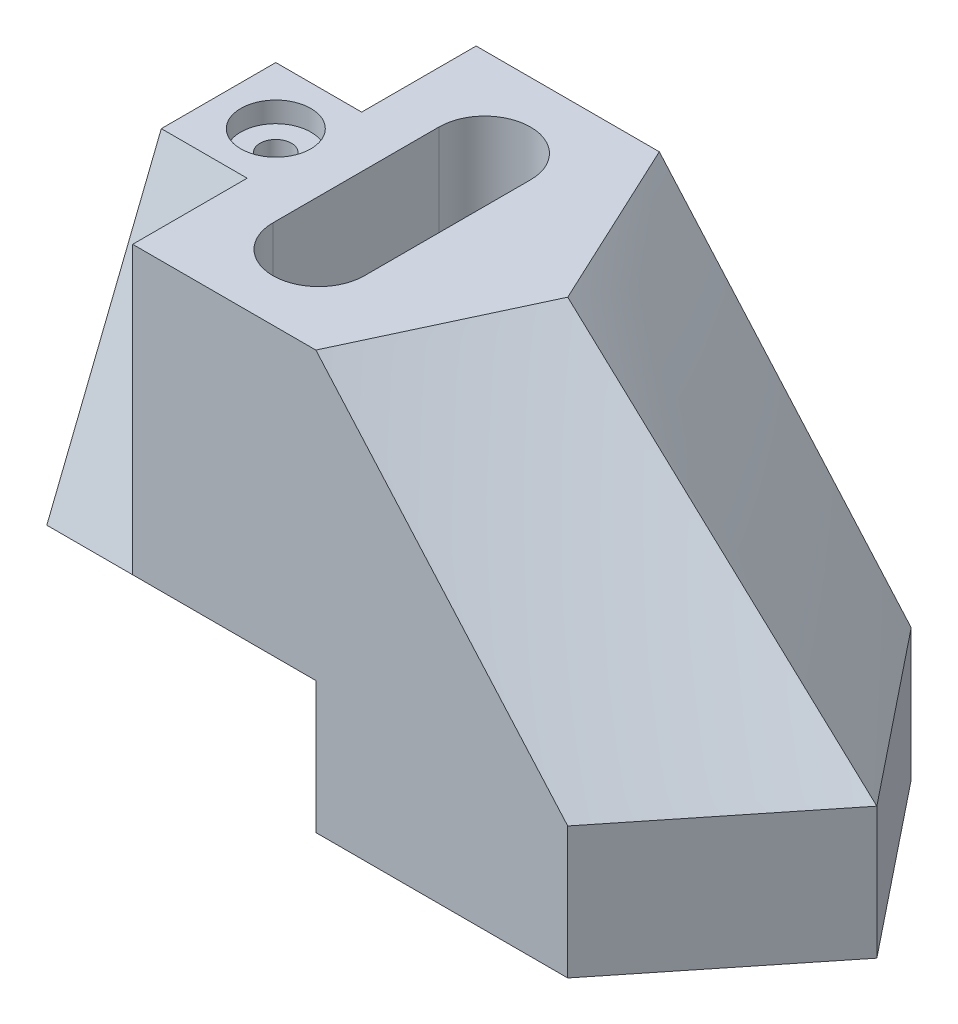
ISO-10303-21;
HEADER;
FILE_DESCRIPTION(('STEP AP214'),'2;1');
FILE_NAME('part.step','',(''),(''),'','','');
FILE_SCHEMA(('AUTOMOTIVE_DESIGN { 1 0 10303 214 1 1 1 1 }'));
ENDSEC;
DATA;
#1=APPLICATION_CONTEXT('core data for automotive mechanical design processes');
#2=APPLICATION_PROTOCOL_DEFINITION('international standard','automotive_design',2000,#1);
#3=PRODUCT_CONTEXT('',#1,'mechanical');
#4=PRODUCT('Part','Part','',(#3));
#5=PRODUCT_RELATED_PRODUCT_CATEGORY('part','',(#4));
#6=PRODUCT_DEFINITION_FORMATION('','',#4);
#7=PRODUCT_DEFINITION_CONTEXT('part definition',#1,'design');
#8=PRODUCT_DEFINITION('design','',#6,#7);
#9=PRODUCT_DEFINITION_SHAPE('','',#8);
#10=(LENGTH_UNIT() NAMED_UNIT(*) SI_UNIT(.MILLI.,.METRE.));
#11=(NAMED_UNIT(*) PLANE_ANGLE_UNIT() SI_UNIT($,.RADIAN.));
#12=(NAMED_UNIT(*) SI_UNIT($,.STERADIAN.) SOLID_ANGLE_UNIT());
#13=UNCERTAINTY_MEASURE_WITH_UNIT(LENGTH_MEASURE(1.E-05),#10,'distance_accuracy_value','');
#14=(GEOMETRIC_REPRESENTATION_CONTEXT(3) GLOBAL_UNCERTAINTY_ASSIGNED_CONTEXT((#13)) GLOBAL_UNIT_ASSIGNED_CONTEXT((#10,
#11,#12)) REPRESENTATION_CONTEXT('',''));
#15=CARTESIAN_POINT('',(0.,0.,0.));
#16=DIRECTION('',(0.,0.,1.));
#17=DIRECTION('',(1.,0.,0.));
#18=AXIS2_PLACEMENT_3D('',#15,#16,#17);
#19=CARTESIAN_POINT('',(0.,0.,-30.));
#20=DIRECTION('',(0.,0.,-1.));
#21=DIRECTION('',(-1.,0.,0.));
#22=AXIS2_PLACEMENT_3D('',#19,#20,#21);
#23=PLANE('',#22);
#24=DIRECTION('',(1.,0.,0.));
#25=VECTOR('',#24,1.);
#26=CARTESIAN_POINT('',(0.,0.,-30.));
#27=LINE('',#26,#25);
#28=CARTESIAN_POINT('',(15.,0.,-30.));
#29=VERTEX_POINT('',#28);
#30=CARTESIAN_POINT('',(47.,0.,-30.));
#31=VERTEX_POINT('',#30);
#32=EDGE_CURVE('E277',#29,#31,#27,.T.);
#33=ORIENTED_EDGE('',*,*,#32,.F.);
#34=DIRECTION('',(0.,-1.,0.));
#35=VECTOR('',#34,1.);
#36=CARTESIAN_POINT('',(15.,50.,-30.));
#37=LINE('',#36,#35);
#38=CARTESIAN_POINT('',(15.,50.,-30.));
#39=VERTEX_POINT('',#38);
#40=EDGE_CURVE('E452',#39,#29,#37,.T.);
#41=ORIENTED_EDGE('',*,*,#40,.F.);
#42=DIRECTION('',(-1.,0.,0.));
#43=VECTOR('',#42,1.);
#44=CARTESIAN_POINT('',(47.,50.,-30.));
#45=LINE('',#44,#43);
#46=CARTESIAN_POINT('',(47.,50.,-30.));
#47=VERTEX_POINT('',#46);
#48=EDGE_CURVE('E442',#47,#39,#45,.T.);
#49=ORIENTED_EDGE('',*,*,#48,.F.);
#50=DIRECTION('',(0.660627894892025,-0.750713516922755,0.));
#51=VECTOR('',#50,1.);
#52=CARTESIAN_POINT('',(47.,50.,-30.));
#53=LINE('',#52,#51);
#54=CARTESIAN_POINT('',(91.,0.,-30.));
#55=VERTEX_POINT('',#54);
#56=EDGE_CURVE('E303',#47,#55,#53,.T.);
#57=ORIENTED_EDGE('',*,*,#56,.T.);
#58=DIRECTION('',(0.,1.,0.));
#59=VECTOR('',#58,1.);
#60=CARTESIAN_POINT('',(91.,-23.,-30.));
#61=LINE('',#60,#59);
#62=CARTESIAN_POINT('',(91.,-23.,-30.));
#63=VERTEX_POINT('',#62);
#64=EDGE_CURVE('E483',#63,#55,#61,.T.);
#65=ORIENTED_EDGE('',*,*,#64,.F.);
#66=DIRECTION('',(1.,0.,0.));
#67=VECTOR('',#66,1.);
#68=CARTESIAN_POINT('',(0.,-23.,-30.));
#69=LINE('',#68,#67);
#70=CARTESIAN_POINT('',(47.,-23.,-30.));
#71=VERTEX_POINT('',#70);
#72=EDGE_CURVE('E287',#71,#63,#69,.T.);
#73=ORIENTED_EDGE('',*,*,#72,.F.);
#74=DIRECTION('',(0.,-1.,0.));
#75=VECTOR('',#74,1.);
#76=CARTESIAN_POINT('',(47.,0.,-30.));
#77=LINE('',#76,#75);
#78=EDGE_CURVE('E274',#31,#71,#77,.T.);
#79=ORIENTED_EDGE('',*,*,#78,.F.);
#80=EDGE_LOOP('',(#33,#41,#49,#57,#65,#73,#79));
#81=FACE_BOUND('',#80,.T.);
#82=ADVANCED_FACE('F49',(#81),#23,.T.);
#83=CARTESIAN_POINT('',(0.,50.,0.));
#84=DIRECTION('',(0.,1.,0.));
#85=DIRECTION('',(0.,0.,1.));
#86=AXIS2_PLACEMENT_3D('',#83,#84,#85);
#87=PLANE('',#86);
#88=CARTESIAN_POINT('',(10.,50.,0.));
#89=DIRECTION('',(0.,1.,0.));
#90=DIRECTION('',(0.,0.,1.));
#91=AXIS2_PLACEMENT_3D('',#88,#89,#90);
#92=CIRCLE('',#91,6.12);
#93=CARTESIAN_POINT('',(10.,50.,6.12));
#94=VERTEX_POINT('',#93);
#95=EDGE_CURVE('E805',#94,#94,#92,.T.);
#96=ORIENTED_EDGE('',*,*,#95,.F.);
#97=EDGE_LOOP('',(#96));
#98=FACE_BOUND('',#97,.T.);
#99=CARTESIAN_POINT('',(32.,50.,-14.5));
#100=DIRECTION('',(0.,1.,0.));
#101=DIRECTION('',(0.,0.,1.));
#102=AXIS2_PLACEMENT_3D('',#99,#100,#101);
#103=CIRCLE('',#102,8.00000000000002);
#104=CARTESIAN_POINT('',(40.,50.,-14.5));
#105=VERTEX_POINT('',#104);
#106=CARTESIAN_POINT('',(24.,50.,-14.5));
#107=VERTEX_POINT('',#106);
#108=EDGE_CURVE('E75',#105,#107,#103,.T.);
#109=ORIENTED_EDGE('',*,*,#108,.F.);
#110=DIRECTION('',(0.,0.,-1.));
#111=VECTOR('',#110,1.);
#112=CARTESIAN_POINT('',(40.,50.,-14.5));
#113=LINE('',#112,#111);
#114=CARTESIAN_POINT('',(40.,50.,14.5));
#115=VERTEX_POINT('',#114);
#116=EDGE_CURVE('E223',#115,#105,#113,.T.);
#117=ORIENTED_EDGE('',*,*,#116,.F.);
#118=CARTESIAN_POINT('',(32.,50.,14.5));
#119=DIRECTION('',(0.,1.,0.));
#120=DIRECTION('',(0.,0.,1.));
#121=AXIS2_PLACEMENT_3D('',#118,#119,#120);
#122=CIRCLE('',#121,8.00000000000001);
#123=CARTESIAN_POINT('',(24.,50.,14.5));
#124=VERTEX_POINT('',#123);
#125=EDGE_CURVE('E237',#124,#115,#122,.T.);
#126=ORIENTED_EDGE('',*,*,#125,.F.);
#127=DIRECTION('',(0.,0.,1.));
#128=VECTOR('',#127,1.);
#129=CARTESIAN_POINT('',(24.,50.,-14.5));
#130=LINE('',#129,#128);
#131=EDGE_CURVE('E234',#107,#124,#130,.T.);
#132=ORIENTED_EDGE('',*,*,#131,.F.);
#133=EDGE_LOOP('',(#109,#117,#126,#132));
#134=FACE_BOUND('',#133,.T.);
#135=DIRECTION('',(-1.,0.,0.));
#136=VECTOR('',#135,1.);
#137=CARTESIAN_POINT('',(15.,50.,-10.));
#138=LINE('',#137,#136);
#139=CARTESIAN_POINT('',(15.,50.,-10.));
#140=VERTEX_POINT('',#139);
#141=CARTESIAN_POINT('',(0.,50.,-10.));
#142=VERTEX_POINT('',#141);
#143=EDGE_CURVE('E424',#140,#142,#138,.T.);
#144=ORIENTED_EDGE('',*,*,#143,.T.);
#145=DIRECTION('',(0.,0.,1.));
#146=VECTOR('',#145,1.);
#147=CARTESIAN_POINT('',(0.,50.,-30.));
#148=LINE('',#147,#146);
#149=CARTESIAN_POINT('',(0.,50.,10.));
#150=VERTEX_POINT('',#149);
#151=EDGE_CURVE('E415',#142,#150,#148,.T.);
#152=ORIENTED_EDGE('',*,*,#151,.T.);
#153=DIRECTION('',(-1.,0.,0.));
#154=VECTOR('',#153,1.);
#155=CARTESIAN_POINT('',(15.,50.,10.));
#156=LINE('',#155,#154);
#157=CARTESIAN_POINT('',(15.,50.,10.));
#158=VERTEX_POINT('',#157);
#159=EDGE_CURVE('E262',#158,#150,#156,.T.);
#160=ORIENTED_EDGE('',*,*,#159,.F.);
#161=DIRECTION('',(0.,0.,-1.));
#162=VECTOR('',#161,1.);
#163=CARTESIAN_POINT('',(15.,50.,10.));
#164=LINE('',#163,#162);
#165=CARTESIAN_POINT('',(15.,50.,30.));
#166=VERTEX_POINT('',#165);
#167=EDGE_CURVE('E263',#166,#158,#164,.T.);
#168=ORIENTED_EDGE('',*,*,#167,.F.);
#169=DIRECTION('',(1.,0.,0.));
#170=VECTOR('',#169,1.);
#171=CARTESIAN_POINT('',(0.,50.,30.));
#172=LINE('',#171,#170);
#173=CARTESIAN_POINT('',(47.,50.,30.));
#174=VERTEX_POINT('',#173);
#175=EDGE_CURVE('E474',#166,#174,#172,.T.);
#176=ORIENTED_EDGE('',*,*,#175,.T.);
#177=DIRECTION('',(0.422885465331124,0.,-0.906183139995265));
#178=VECTOR('',#177,1.);
#179=CARTESIAN_POINT('',(47.,50.,30.));
#180=LINE('',#179,#178);
#181=CARTESIAN_POINT('',(61.,50.,0.));
#182=VERTEX_POINT('',#181);
#183=EDGE_CURVE('E362',#174,#182,#180,.T.);
#184=ORIENTED_EDGE('',*,*,#183,.T.);
#185=DIRECTION('',(-0.422885465331124,0.,-0.906183139995265));
#186=VECTOR('',#185,1.);
#187=CARTESIAN_POINT('',(61.,50.,0.));
#188=LINE('',#187,#186);
#189=EDGE_CURVE('E297',#182,#47,#188,.T.);
#190=ORIENTED_EDGE('',*,*,#189,.T.);
#191=ORIENTED_EDGE('',*,*,#48,.T.);
#192=DIRECTION('',(0.,0.,-1.));
#193=VECTOR('',#192,1.);
#194=CARTESIAN_POINT('',(15.,50.,-10.));
#195=LINE('',#194,#193);
#196=EDGE_CURVE('E253',#140,#39,#195,.T.);
#197=ORIENTED_EDGE('',*,*,#196,.F.);
#198=EDGE_LOOP('',(#144,#152,#160,#168,#176,#184,#190,#191,#197));
#199=FACE_BOUND('',#198,.T.);
#200=ADVANCED_FACE('F373',(#98,#134,#199),#87,.T.);
#201=CARTESIAN_POINT('',(0.,0.,0.));
#202=DIRECTION('',(-1.,0.,0.));
#203=DIRECTION('',(0.,0.,1.));
#204=AXIS2_PLACEMENT_3D('',#201,#202,#203);
#205=PLANE('',#204);
#206=DIRECTION('',(0.,0.928476690885259,0.371390676354104));
#207=VECTOR('',#206,1.);
#208=CARTESIAN_POINT('',(0.,0.,-30.));
#209=LINE('',#208,#207);
#210=CARTESIAN_POINT('',(0.,0.,-30.));
#211=VERTEX_POINT('',#210);
#212=EDGE_CURVE('E244',#211,#142,#209,.T.);
#213=ORIENTED_EDGE('',*,*,#212,.F.);
#214=DIRECTION('',(0.,0.,1.));
#215=VECTOR('',#214,1.);
#216=CARTESIAN_POINT('',(0.,0.,-30.0001));
#217=LINE('',#216,#215);
#218=CARTESIAN_POINT('',(0.,0.,30.));
#219=VERTEX_POINT('',#218);
#220=EDGE_CURVE('E271',#211,#219,#217,.T.);
#221=ORIENTED_EDGE('',*,*,#220,.T.);
#222=DIRECTION('',(0.,-0.928476690885259,0.371390676354104));
#223=VECTOR('',#222,1.);
#224=CARTESIAN_POINT('',(0.,0.,30.));
#225=LINE('',#224,#223);
#226=EDGE_CURVE('E258',#150,#219,#225,.T.);
#227=ORIENTED_EDGE('',*,*,#226,.F.);
#228=ORIENTED_EDGE('',*,*,#151,.F.);
#229=EDGE_LOOP('',(#213,#221,#227,#228));
#230=FACE_BOUND('',#229,.T.);
#231=ADVANCED_FACE('F317',(#230),#205,.T.);
#232=CARTESIAN_POINT('',(47.,50.,-30.));
#233=CARTESIAN_POINT('',(91.,0.,-30.));
#234=CARTESIAN_POINT('',(49.3333333333333,50.,-25.));
#235=CARTESIAN_POINT('',(95.,0.,-25.));
#236=CARTESIAN_POINT('',(51.6666666666667,50.,-20.));
#237=CARTESIAN_POINT('',(99.,0.,-20.));
#238=CARTESIAN_POINT('',(56.3333333333333,50.,-10.));
#239=CARTESIAN_POINT('',(107.,0.,-10.));
#240=CARTESIAN_POINT('',(58.6666666666667,50.,-5.));
#241=CARTESIAN_POINT('',(111.,0.,-5.00000000000001));
#242=CARTESIAN_POINT('',(61.,50.,0.));
#243=CARTESIAN_POINT('',(115.,0.,0.));
#244=B_SPLINE_SURFACE_WITH_KNOTS('',3,1,((#232,#233),(#234,#235),(#236,#237),(#238,#239),(#240,
#241),(#242,#243)),.UNSPECIFIED.,.F.,.F.,.F.,(4,2,4),(2,2),(0.,0.5,1.),(0.,1.),.UNSPECIFIED.);
#245=DIRECTION('',(0.733760674018169,-0.679408031498305,0.));
#246=VECTOR('',#245,1.);
#247=CARTESIAN_POINT('',(88.,25.,0.));
#248=LINE('',#247,#246);
#249=CARTESIAN_POINT('',(115.,0.,0.));
#250=VERTEX_POINT('',#249);
#251=EDGE_CURVE('E456',#182,#250,#248,.T.);
#252=DIRECTION('',(-0.624695047554424,0.,-0.78086880944303));
#253=VECTOR('',#252,1.);
#254=CARTESIAN_POINT('',(91.,0.,-30.));
#255=LINE('',#254,#253);
#256=EDGE_CURVE('E59',#250,#55,#255,.T.);
#257=ORIENTED_EDGE('',*,*,#189,.F.);
#258=ORIENTED_EDGE('',*,*,#251,.T.);
#259=ORIENTED_EDGE('',*,*,#256,.T.);
#260=ORIENTED_EDGE('',*,*,#56,.F.);
#261=EDGE_LOOP('',(#257,#258,#259,#260));
#262=FACE_BOUND('',#261,.T.);
#263=ADVANCED_FACE('F305',(#262),#244,.T.);
#264=CARTESIAN_POINT('',(61.,50.,0.));
#265=CARTESIAN_POINT('',(115.,0.,0.));
#266=CARTESIAN_POINT('',(58.6666666666667,50.,5.));
#267=CARTESIAN_POINT('',(111.,0.,4.99999999999993));
#268=CARTESIAN_POINT('',(56.3333333333333,50.,9.99999999999999));
#269=CARTESIAN_POINT('',(107.,0.,9.9999999999999));
#270=CARTESIAN_POINT('',(51.6666666666667,50.,20.));
#271=CARTESIAN_POINT('',(99.0000000000001,0.,19.9999999999999));
#272=CARTESIAN_POINT('',(49.3333333333333,50.,25.));
#273=CARTESIAN_POINT('',(95.,0.,24.9999999999999));
#274=CARTESIAN_POINT('',(47.,50.,30.));
#275=CARTESIAN_POINT('',(91.,0.,30.));
#276=B_SPLINE_SURFACE_WITH_KNOTS('',3,1,((#264,#265),(#266,#267),(#268,#269),(#270,#271),(#272,
#273),(#274,#275)),.UNSPECIFIED.,.F.,.F.,.F.,(4,2,4),(2,2),(0.,0.5,1.),(0.,1.),.UNSPECIFIED.);
#277=DIRECTION('',(0.660627894892025,-0.750713516922755,0.));
#278=VECTOR('',#277,1.);
#279=CARTESIAN_POINT('',(69.,25.,30.));
#280=LINE('',#279,#278);
#281=CARTESIAN_POINT('',(91.,0.,30.));
#282=VERTEX_POINT('',#281);
#283=EDGE_CURVE('E457',#174,#282,#280,.T.);
#284=DIRECTION('',(0.624695047554424,0.,-0.78086880944303));
#285=VECTOR('',#284,1.);
#286=CARTESIAN_POINT('',(91.,0.,30.));
#287=LINE('',#286,#285);
#288=EDGE_CURVE('E346',#282,#250,#287,.T.);
#289=ORIENTED_EDGE('',*,*,#183,.F.);
#290=ORIENTED_EDGE('',*,*,#283,.T.);
#291=ORIENTED_EDGE('',*,*,#288,.T.);
#292=ORIENTED_EDGE('',*,*,#251,.F.);
#293=EDGE_LOOP('',(#289,#290,#291,#292));
#294=FACE_BOUND('',#293,.T.);
#295=ADVANCED_FACE('F316',(#294),#276,.T.);
#296=CARTESIAN_POINT('',(0.,0.,30.));
#297=DIRECTION('',(0.,0.,1.));
#298=DIRECTION('',(1.,0.,0.));
#299=AXIS2_PLACEMENT_3D('',#296,#297,#298);
#300=PLANE('',#299);
#301=DIRECTION('',(0.,1.,0.));
#302=VECTOR('',#301,1.);
#303=CARTESIAN_POINT('',(15.,50.,30.));
#304=LINE('',#303,#302);
#305=CARTESIAN_POINT('',(15.,0.,30.));
#306=VERTEX_POINT('',#305);
#307=EDGE_CURVE('E257',#306,#166,#304,.T.);
#308=ORIENTED_EDGE('',*,*,#307,.F.);
#309=DIRECTION('',(-1.,0.,0.));
#310=VECTOR('',#309,1.);
#311=CARTESIAN_POINT('',(0.,0.,30.));
#312=LINE('',#311,#310);
#313=CARTESIAN_POINT('',(47.,0.,30.));
#314=VERTEX_POINT('',#313);
#315=EDGE_CURVE('E267',#314,#306,#312,.T.);
#316=ORIENTED_EDGE('',*,*,#315,.F.);
#317=DIRECTION('',(0.,1.,0.));
#318=VECTOR('',#317,1.);
#319=CARTESIAN_POINT('',(47.,0.,30.));
#320=LINE('',#319,#318);
#321=CARTESIAN_POINT('',(47.,-23.,30.));
#322=VERTEX_POINT('',#321);
#323=EDGE_CURVE('E264',#322,#314,#320,.T.);
#324=ORIENTED_EDGE('',*,*,#323,.F.);
#325=DIRECTION('',(-1.,0.,0.));
#326=VECTOR('',#325,1.);
#327=CARTESIAN_POINT('',(91.,-23.,30.));
#328=LINE('',#327,#326);
#329=CARTESIAN_POINT('',(91.,-23.,30.));
#330=VERTEX_POINT('',#329);
#331=EDGE_CURVE('E284',#330,#322,#328,.T.);
#332=ORIENTED_EDGE('',*,*,#331,.F.);
#333=DIRECTION('',(0.,1.,0.));
#334=VECTOR('',#333,1.);
#335=CARTESIAN_POINT('',(91.,-23.,30.));
#336=LINE('',#335,#334);
#337=EDGE_CURVE('E454',#330,#282,#336,.T.);
#338=ORIENTED_EDGE('',*,*,#337,.T.);
#339=ORIENTED_EDGE('',*,*,#283,.F.);
#340=ORIENTED_EDGE('',*,*,#175,.F.);
#341=EDGE_LOOP('',(#308,#316,#324,#332,#338,#339,#340));
#342=FACE_BOUND('',#341,.T.);
#343=ADVANCED_FACE('F51',(#342),#300,.T.);
#344=CARTESIAN_POINT('',(115.,-23.,0.));
#345=DIRECTION('',(-0.78086880944303,0.,-0.624695047554424));
#346=DIRECTION('',(-0.624695047554424,0.,0.78086880944303));
#347=AXIS2_PLACEMENT_3D('',#344,#345,#346);
#348=PLANE('',#347);
#349=ORIENTED_EDGE('',*,*,#288,.F.);
#350=ORIENTED_EDGE('',*,*,#337,.F.);
#351=DIRECTION('',(-0.624695047554424,0.,0.78086880944303));
#352=VECTOR('',#351,1.);
#353=CARTESIAN_POINT('',(115.,-23.,0.));
#354=LINE('',#353,#352);
#355=CARTESIAN_POINT('',(115.,-23.,0.));
#356=VERTEX_POINT('',#355);
#357=EDGE_CURVE('E281',#356,#330,#354,.T.);
#358=ORIENTED_EDGE('',*,*,#357,.F.);
#359=DIRECTION('',(0.,1.,0.));
#360=VECTOR('',#359,1.);
#361=CARTESIAN_POINT('',(115.,-23.,0.));
#362=LINE('',#361,#360);
#363=EDGE_CURVE('E291',#356,#250,#362,.T.);
#364=ORIENTED_EDGE('',*,*,#363,.T.);
#365=EDGE_LOOP('',(#349,#350,#358,#364));
#366=FACE_BOUND('',#365,.T.);
#367=ADVANCED_FACE('F383',(#366),#348,.F.);
#368=CARTESIAN_POINT('',(91.,-23.,-30.));
#369=DIRECTION('',(-0.78086880944303,0.,0.624695047554424));
#370=DIRECTION('',(0.624695047554424,0.,0.78086880944303));
#371=AXIS2_PLACEMENT_3D('',#368,#369,#370);
#372=PLANE('',#371);
#373=ORIENTED_EDGE('',*,*,#256,.F.);
#374=ORIENTED_EDGE('',*,*,#363,.F.);
#375=DIRECTION('',(0.624695047554424,0.,0.78086880944303));
#376=VECTOR('',#375,1.);
#377=CARTESIAN_POINT('',(91.,-23.,-30.));
#378=LINE('',#377,#376);
#379=EDGE_CURVE('E289',#63,#356,#378,.T.);
#380=ORIENTED_EDGE('',*,*,#379,.F.);
#381=ORIENTED_EDGE('',*,*,#64,.T.);
#382=EDGE_LOOP('',(#373,#374,#380,#381));
#383=FACE_BOUND('',#382,.T.);
#384=ADVANCED_FACE('F509',(#383),#372,.F.);
#385=CARTESIAN_POINT('',(0.,-23.,0.));
#386=DIRECTION('',(0.,1.,0.));
#387=DIRECTION('',(0.,0.,1.));
#388=AXIS2_PLACEMENT_3D('',#385,#386,#387);
#389=PLANE('',#388);
#390=ORIENTED_EDGE('',*,*,#331,.T.);
#391=DIRECTION('',(0.,0.,-1.));
#392=VECTOR('',#391,1.);
#393=CARTESIAN_POINT('',(47.,-23.,0.));
#394=LINE('',#393,#392);
#395=EDGE_CURVE('E12',#322,#71,#394,.T.);
#396=ORIENTED_EDGE('',*,*,#395,.T.);
#397=ORIENTED_EDGE('',*,*,#72,.T.);
#398=ORIENTED_EDGE('',*,*,#379,.T.);
#399=ORIENTED_EDGE('',*,*,#357,.T.);
#400=EDGE_LOOP('',(#390,#396,#397,#398,#399));
#401=FACE_BOUND('',#400,.T.);
#402=ADVANCED_FACE('F514',(#401),#389,.F.);
#403=CARTESIAN_POINT('',(0.,0.,-30.0001));
#404=DIRECTION('',(0.,1.,0.));
#405=DIRECTION('',(0.,0.,1.));
#406=AXIS2_PLACEMENT_3D('',#403,#404,#405);
#407=PLANE('',#406);
#408=CARTESIAN_POINT('',(10.,0.,0.));
#409=DIRECTION('',(0.,1.,0.));
#410=DIRECTION('',(0.,0.,1.));
#411=AXIS2_PLACEMENT_3D('',#408,#409,#410);
#412=CIRCLE('',#411,2.75);
#413=CARTESIAN_POINT('',(10.,0.,2.75));
#414=VERTEX_POINT('',#413);
#415=EDGE_CURVE('E54',#414,#414,#412,.T.);
#416=ORIENTED_EDGE('',*,*,#415,.T.);
#417=EDGE_LOOP('',(#416));
#418=FACE_BOUND('',#417,.T.);
#419=CARTESIAN_POINT('',(32.,0.,-14.5));
#420=DIRECTION('',(0.,1.,0.));
#421=DIRECTION('',(0.,0.,1.));
#422=AXIS2_PLACEMENT_3D('',#419,#420,#421);
#423=CIRCLE('',#422,3.00000000000001);
#424=CARTESIAN_POINT('',(35.,0.,-14.5));
#425=VERTEX_POINT('',#424);
#426=CARTESIAN_POINT('',(29.,0.,-14.5));
#427=VERTEX_POINT('',#426);
#428=EDGE_CURVE('E207',#425,#427,#423,.T.);
#429=ORIENTED_EDGE('',*,*,#428,.T.);
#430=DIRECTION('',(0.,0.,1.));
#431=VECTOR('',#430,1.);
#432=CARTESIAN_POINT('',(29.,0.,-30.0001));
#433=LINE('',#432,#431);
#434=CARTESIAN_POINT('',(29.,0.,14.5));
#435=VERTEX_POINT('',#434);
#436=EDGE_CURVE('E198',#427,#435,#433,.T.);
#437=ORIENTED_EDGE('',*,*,#436,.T.);
#438=CARTESIAN_POINT('',(32.,0.,14.5));
#439=DIRECTION('',(0.,1.,0.));
#440=DIRECTION('',(0.,0.,1.));
#441=AXIS2_PLACEMENT_3D('',#438,#439,#440);
#442=CIRCLE('',#441,3.00000000000001);
#443=CARTESIAN_POINT('',(35.,0.,14.5));
#444=VERTEX_POINT('',#443);
#445=EDGE_CURVE('E184',#435,#444,#442,.T.);
#446=ORIENTED_EDGE('',*,*,#445,.T.);
#447=DIRECTION('',(0.,0.,1.));
#448=VECTOR('',#447,1.);
#449=CARTESIAN_POINT('',(35.,0.,-30.0001));
#450=LINE('',#449,#448);
#451=EDGE_CURVE('E192',#425,#444,#450,.T.);
#452=ORIENTED_EDGE('',*,*,#451,.F.);
#453=EDGE_LOOP('',(#429,#437,#446,#452));
#454=FACE_BOUND('',#453,.T.);
#455=EDGE_CURVE('E278',#211,#29,#27,.T.);
#456=ORIENTED_EDGE('',*,*,#455,.T.);
#457=ORIENTED_EDGE('',*,*,#32,.T.);
#458=DIRECTION('',(0.,0.,1.));
#459=VECTOR('',#458,1.);
#460=CARTESIAN_POINT('',(47.,0.,-30.0001));
#461=LINE('',#460,#459);
#462=EDGE_CURVE('E270',#31,#314,#461,.T.);
#463=ORIENTED_EDGE('',*,*,#462,.T.);
#464=ORIENTED_EDGE('',*,*,#315,.T.);
#465=DIRECTION('',(-1.,0.,0.));
#466=VECTOR('',#465,1.);
#467=CARTESIAN_POINT('',(15.,0.,30.));
#468=LINE('',#467,#466);
#469=EDGE_CURVE('E259',#306,#219,#468,.T.);
#470=ORIENTED_EDGE('',*,*,#469,.T.);
#471=ORIENTED_EDGE('',*,*,#220,.F.);
#472=EDGE_LOOP('',(#456,#457,#463,#464,#470,#471));
#473=FACE_BOUND('',#472,.T.);
#474=ADVANCED_FACE('F205',(#418,#454,#473),#407,.F.);
#475=CARTESIAN_POINT('',(47.,0.,-30.0001));
#476=DIRECTION('',(1.,0.,0.));
#477=DIRECTION('',(0.,0.,-1.));
#478=AXIS2_PLACEMENT_3D('',#475,#476,#477);
#479=PLANE('',#478);
#480=ORIENTED_EDGE('',*,*,#78,.T.);
#481=ORIENTED_EDGE('',*,*,#395,.F.);
#482=ORIENTED_EDGE('',*,*,#323,.T.);
#483=ORIENTED_EDGE('',*,*,#462,.F.);
#484=EDGE_LOOP('',(#480,#481,#482,#483));
#485=FACE_BOUND('',#484,.T.);
#486=ADVANCED_FACE('F516',(#485),#479,.F.);
#487=CARTESIAN_POINT('',(15.,0.,30.));
#488=DIRECTION('',(0.,-0.371390676354104,-0.928476690885259));
#489=DIRECTION('',(0.,0.92847669088526,-0.371390676354104));
#490=AXIS2_PLACEMENT_3D('',#487,#488,#489);
#491=PLANE('',#490);
#492=ORIENTED_EDGE('',*,*,#226,.T.);
#493=ORIENTED_EDGE('',*,*,#469,.F.);
#494=DIRECTION('',(0.,-0.928476690885259,0.371390676354104));
#495=VECTOR('',#494,1.);
#496=CARTESIAN_POINT('',(15.,0.,30.));
#497=LINE('',#496,#495);
#498=EDGE_CURVE('E254',#158,#306,#497,.T.);
#499=ORIENTED_EDGE('',*,*,#498,.F.);
#500=ORIENTED_EDGE('',*,*,#159,.T.);
#501=EDGE_LOOP('',(#492,#493,#499,#500));
#502=FACE_BOUND('',#501,.T.);
#503=ADVANCED_FACE('F566',(#502),#491,.F.);
#504=CARTESIAN_POINT('',(15.,0.,0.));
#505=DIRECTION('',(1.,0.,0.));
#506=DIRECTION('',(0.,0.,-1.));
#507=AXIS2_PLACEMENT_3D('',#504,#505,#506);
#508=PLANE('',#507);
#509=ORIENTED_EDGE('',*,*,#498,.T.);
#510=ORIENTED_EDGE('',*,*,#307,.T.);
#511=ORIENTED_EDGE('',*,*,#167,.T.);
#512=EDGE_LOOP('',(#509,#510,#511));
#513=FACE_BOUND('',#512,.T.);
#514=ADVANCED_FACE('F572',(#513),#508,.F.);
#515=CARTESIAN_POINT('',(15.,0.,-30.));
#516=DIRECTION('',(0.,-0.371390676354104,0.928476690885259));
#517=DIRECTION('',(0.,-0.92847669088526,-0.371390676354104));
#518=AXIS2_PLACEMENT_3D('',#515,#516,#517);
#519=PLANE('',#518);
#520=ORIENTED_EDGE('',*,*,#212,.T.);
#521=ORIENTED_EDGE('',*,*,#143,.F.);
#522=DIRECTION('',(0.,0.928476690885259,0.371390676354104));
#523=VECTOR('',#522,1.);
#524=CARTESIAN_POINT('',(15.,0.,-30.));
#525=LINE('',#524,#523);
#526=EDGE_CURVE('E250',#29,#140,#525,.T.);
#527=ORIENTED_EDGE('',*,*,#526,.F.);
#528=ORIENTED_EDGE('',*,*,#455,.F.);
#529=EDGE_LOOP('',(#520,#521,#527,#528));
#530=FACE_BOUND('',#529,.T.);
#531=ADVANCED_FACE('F522',(#530),#519,.F.);
#532=CARTESIAN_POINT('',(15.,0.,0.));
#533=DIRECTION('',(-1.,0.,0.));
#534=DIRECTION('',(0.,0.,1.));
#535=AXIS2_PLACEMENT_3D('',#532,#533,#534);
#536=PLANE('',#535);
#537=ORIENTED_EDGE('',*,*,#526,.T.);
#538=ORIENTED_EDGE('',*,*,#196,.T.);
#539=ORIENTED_EDGE('',*,*,#40,.T.);
#540=EDGE_LOOP('',(#537,#538,#539));
#541=FACE_BOUND('',#540,.T.);
#542=ADVANCED_FACE('F578',(#541),#536,.T.);
#543=CARTESIAN_POINT('',(32.,30.,-14.5));
#544=DIRECTION('',(0.,1.,0.));
#545=DIRECTION('',(0.,0.,1.));
#546=AXIS2_PLACEMENT_3D('',#543,#544,#545);
#547=CYLINDRICAL_SURFACE('',#546,8.00000000000002);
#548=ORIENTED_EDGE('',*,*,#108,.T.);
#549=DIRECTION('',(0.,1.,0.));
#550=VECTOR('',#549,1.);
#551=CARTESIAN_POINT('',(24.,30.,-14.5));
#552=LINE('',#551,#550);
#553=CARTESIAN_POINT('',(24.,30.,-14.5));
#554=VERTEX_POINT('',#553);
#555=EDGE_CURVE('E232',#554,#107,#552,.T.);
#556=ORIENTED_EDGE('',*,*,#555,.F.);
#557=CARTESIAN_POINT('',(32.,30.,-14.5));
#558=DIRECTION('',(0.,1.,0.));
#559=DIRECTION('',(0.,0.,1.));
#560=AXIS2_PLACEMENT_3D('',#557,#558,#559);
#561=CIRCLE('',#560,8.00000000000002);
#562=CARTESIAN_POINT('',(40.,30.,-14.5));
#563=VERTEX_POINT('',#562);
#564=EDGE_CURVE('E219',#563,#554,#561,.T.);
#565=ORIENTED_EDGE('',*,*,#564,.F.);
#566=DIRECTION('',(0.,1.,0.));
#567=VECTOR('',#566,1.);
#568=CARTESIAN_POINT('',(40.,30.,-14.5));
#569=LINE('',#568,#567);
#570=EDGE_CURVE('E242',#563,#105,#569,.T.);
#571=ORIENTED_EDGE('',*,*,#570,.T.);
#572=EDGE_LOOP('',(#548,#556,#565,#571));
#573=FACE_BOUND('',#572,.T.);
#574=ADVANCED_FACE('F581',(#573),#547,.F.);
#575=CARTESIAN_POINT('',(40.,30.,-14.5));
#576=DIRECTION('',(1.,0.,0.));
#577=DIRECTION('',(0.,0.,-1.));
#578=AXIS2_PLACEMENT_3D('',#575,#576,#577);
#579=PLANE('',#578);
#580=ORIENTED_EDGE('',*,*,#116,.T.);
#581=ORIENTED_EDGE('',*,*,#570,.F.);
#582=DIRECTION('',(0.,0.,-1.));
#583=VECTOR('',#582,1.);
#584=CARTESIAN_POINT('',(40.,30.,-14.5));
#585=LINE('',#584,#583);
#586=CARTESIAN_POINT('',(40.,30.,14.5));
#587=VERTEX_POINT('',#586);
#588=EDGE_CURVE('E229',#587,#563,#585,.T.);
#589=ORIENTED_EDGE('',*,*,#588,.F.);
#590=DIRECTION('',(0.,1.,0.));
#591=VECTOR('',#590,1.);
#592=CARTESIAN_POINT('',(40.,30.,14.5));
#593=LINE('',#592,#591);
#594=EDGE_CURVE('E245',#587,#115,#593,.T.);
#595=ORIENTED_EDGE('',*,*,#594,.T.);
#596=EDGE_LOOP('',(#580,#581,#589,#595));
#597=FACE_BOUND('',#596,.T.);
#598=ADVANCED_FACE('F584',(#597),#579,.F.);
#599=CARTESIAN_POINT('',(32.,30.,14.5));
#600=DIRECTION('',(0.,1.,0.));
#601=DIRECTION('',(0.,0.,1.));
#602=AXIS2_PLACEMENT_3D('',#599,#600,#601);
#603=CYLINDRICAL_SURFACE('',#602,8.00000000000001);
#604=ORIENTED_EDGE('',*,*,#125,.T.);
#605=ORIENTED_EDGE('',*,*,#594,.F.);
#606=CARTESIAN_POINT('',(32.,30.,14.5));
#607=DIRECTION('',(0.,1.,0.));
#608=DIRECTION('',(0.,0.,1.));
#609=AXIS2_PLACEMENT_3D('',#606,#607,#608);
#610=CIRCLE('',#609,8.00000000000001);
#611=CARTESIAN_POINT('',(24.,30.,14.5));
#612=VERTEX_POINT('',#611);
#613=EDGE_CURVE('E226',#612,#587,#610,.T.);
#614=ORIENTED_EDGE('',*,*,#613,.F.);
#615=DIRECTION('',(0.,1.,0.));
#616=VECTOR('',#615,1.);
#617=CARTESIAN_POINT('',(24.,30.,14.5));
#618=LINE('',#617,#616);
#619=EDGE_CURVE('E247',#612,#124,#618,.T.);
#620=ORIENTED_EDGE('',*,*,#619,.T.);
#621=EDGE_LOOP('',(#604,#605,#614,#620));
#622=FACE_BOUND('',#621,.T.);
#623=ADVANCED_FACE('F589',(#622),#603,.F.);
#624=CARTESIAN_POINT('',(24.,30.,-14.5));
#625=DIRECTION('',(-1.,0.,0.));
#626=DIRECTION('',(0.,0.,1.));
#627=AXIS2_PLACEMENT_3D('',#624,#625,#626);
#628=PLANE('',#627);
#629=ORIENTED_EDGE('',*,*,#131,.T.);
#630=ORIENTED_EDGE('',*,*,#619,.F.);
#631=DIRECTION('',(0.,0.,1.));
#632=VECTOR('',#631,1.);
#633=CARTESIAN_POINT('',(24.,30.,-14.5));
#634=LINE('',#633,#632);
#635=EDGE_CURVE('E222',#554,#612,#634,.T.);
#636=ORIENTED_EDGE('',*,*,#635,.F.);
#637=ORIENTED_EDGE('',*,*,#555,.T.);
#638=EDGE_LOOP('',(#629,#630,#636,#637));
#639=FACE_BOUND('',#638,.T.);
#640=ADVANCED_FACE('F585',(#639),#628,.F.);
#641=CARTESIAN_POINT('',(32.,30.,-14.5));
#642=DIRECTION('',(0.,1.,0.));
#643=DIRECTION('',(0.,0.,1.));
#644=AXIS2_PLACEMENT_3D('',#641,#642,#643);
#645=PLANE('',#644);
#646=DIRECTION('',(0.,0.,-1.));
#647=VECTOR('',#646,1.);
#648=CARTESIAN_POINT('',(35.,30.,-14.5));
#649=LINE('',#648,#647);
#650=CARTESIAN_POINT('',(35.,30.,14.5));
#651=VERTEX_POINT('',#650);
#652=CARTESIAN_POINT('',(35.,30.,-14.5));
#653=VERTEX_POINT('',#652);
#654=EDGE_CURVE('E217',#651,#653,#649,.T.);
#655=ORIENTED_EDGE('',*,*,#654,.F.);
#656=CARTESIAN_POINT('',(32.,30.,14.5));
#657=DIRECTION('',(0.,1.,0.));
#658=DIRECTION('',(0.,0.,1.));
#659=AXIS2_PLACEMENT_3D('',#656,#657,#658);
#660=CIRCLE('',#659,3.00000000000001);
#661=CARTESIAN_POINT('',(29.,30.,14.5));
#662=VERTEX_POINT('',#661);
#663=EDGE_CURVE('E215',#662,#651,#660,.T.);
#664=ORIENTED_EDGE('',*,*,#663,.F.);
#665=DIRECTION('',(0.,0.,1.));
#666=VECTOR('',#665,1.);
#667=CARTESIAN_POINT('',(29.,30.,-14.5));
#668=LINE('',#667,#666);
#669=CARTESIAN_POINT('',(29.,30.,-14.5));
#670=VERTEX_POINT('',#669);
#671=EDGE_CURVE('E201',#670,#662,#668,.T.);
#672=ORIENTED_EDGE('',*,*,#671,.F.);
#673=CARTESIAN_POINT('',(32.,30.,-14.5));
#674=DIRECTION('',(0.,1.,0.));
#675=DIRECTION('',(0.,0.,1.));
#676=AXIS2_PLACEMENT_3D('',#673,#674,#675);
#677=CIRCLE('',#676,3.00000000000001);
#678=EDGE_CURVE('E208',#653,#670,#677,.T.);
#679=ORIENTED_EDGE('',*,*,#678,.F.);
#680=EDGE_LOOP('',(#655,#664,#672,#679));
#681=FACE_BOUND('',#680,.T.);
#682=ORIENTED_EDGE('',*,*,#564,.T.);
#683=ORIENTED_EDGE('',*,*,#635,.T.);
#684=ORIENTED_EDGE('',*,*,#613,.T.);
#685=ORIENTED_EDGE('',*,*,#588,.T.);
#686=EDGE_LOOP('',(#682,#683,#684,#685));
#687=FACE_BOUND('',#686,.T.);
#688=ADVANCED_FACE('F588',(#681,#687),#645,.T.);
#689=CARTESIAN_POINT('',(29.,-23.000025,0.));
#690=DIRECTION('',(-1.,0.,0.));
#691=DIRECTION('',(0.,0.,1.));
#692=AXIS2_PLACEMENT_3D('',#689,#690,#691);
#693=PLANE('',#692);
#694=DIRECTION('',(0.,1.,0.));
#695=VECTOR('',#694,1.);
#696=CARTESIAN_POINT('',(29.,-23.000025,-14.5));
#697=LINE('',#696,#695);
#698=EDGE_CURVE('E193',#427,#670,#697,.T.);
#699=ORIENTED_EDGE('',*,*,#698,.T.);
#700=ORIENTED_EDGE('',*,*,#671,.T.);
#701=DIRECTION('',(0.,1.,0.));
#702=VECTOR('',#701,1.);
#703=CARTESIAN_POINT('',(29.,-23.000025,14.5));
#704=LINE('',#703,#702);
#705=EDGE_CURVE('E187',#435,#662,#704,.T.);
#706=ORIENTED_EDGE('',*,*,#705,.F.);
#707=ORIENTED_EDGE('',*,*,#436,.F.);
#708=EDGE_LOOP('',(#699,#700,#706,#707));
#709=FACE_BOUND('',#708,.T.);
#710=ADVANCED_FACE('F197',(#709),#693,.F.);
#711=CARTESIAN_POINT('',(32.,-23.000025,-14.5));
#712=DIRECTION('',(0.,1.,0.));
#713=DIRECTION('',(0.,0.,1.));
#714=AXIS2_PLACEMENT_3D('',#711,#712,#713);
#715=CYLINDRICAL_SURFACE('',#714,3.00000000000001);
#716=DIRECTION('',(0.,1.,0.));
#717=VECTOR('',#716,1.);
#718=CARTESIAN_POINT('',(35.,-23.000025,-14.5));
#719=LINE('',#718,#717);
#720=EDGE_CURVE('E813',#425,#653,#719,.T.);
#721=ORIENTED_EDGE('',*,*,#720,.T.);
#722=ORIENTED_EDGE('',*,*,#678,.T.);
#723=ORIENTED_EDGE('',*,*,#698,.F.);
#724=ORIENTED_EDGE('',*,*,#428,.F.);
#725=EDGE_LOOP('',(#721,#722,#723,#724));
#726=FACE_BOUND('',#725,.T.);
#727=ADVANCED_FACE('F602',(#726),#715,.F.);
#728=CARTESIAN_POINT('',(35.,-23.000025,0.));
#729=DIRECTION('',(-1.,0.,0.));
#730=DIRECTION('',(0.,0.,1.));
#731=AXIS2_PLACEMENT_3D('',#728,#729,#730);
#732=PLANE('',#731);
#733=ORIENTED_EDGE('',*,*,#451,.T.);
#734=DIRECTION('',(0.,1.,0.));
#735=VECTOR('',#734,1.);
#736=CARTESIAN_POINT('',(35.,-23.000025,14.5));
#737=LINE('',#736,#735);
#738=EDGE_CURVE('E67',#444,#651,#737,.T.);
#739=ORIENTED_EDGE('',*,*,#738,.T.);
#740=ORIENTED_EDGE('',*,*,#654,.T.);
#741=ORIENTED_EDGE('',*,*,#720,.F.);
#742=EDGE_LOOP('',(#733,#739,#740,#741));
#743=FACE_BOUND('',#742,.T.);
#744=ADVANCED_FACE('F606',(#743),#732,.T.);
#745=CARTESIAN_POINT('',(32.,-23.000025,14.5));
#746=DIRECTION('',(0.,1.,0.));
#747=DIRECTION('',(0.,0.,1.));
#748=AXIS2_PLACEMENT_3D('',#745,#746,#747);
#749=CYLINDRICAL_SURFACE('',#748,3.00000000000001);
#750=ORIENTED_EDGE('',*,*,#705,.T.);
#751=ORIENTED_EDGE('',*,*,#663,.T.);
#752=ORIENTED_EDGE('',*,*,#738,.F.);
#753=ORIENTED_EDGE('',*,*,#445,.F.);
#754=EDGE_LOOP('',(#750,#751,#752,#753));
#755=FACE_BOUND('',#754,.T.);
#756=ADVANCED_FACE('F186',(#755),#749,.F.);
#757=CARTESIAN_POINT('',(10.,50.,0.));
#758=DIRECTION('',(0.,1.,0.));
#759=DIRECTION('',(0.,0.,1.));
#760=AXIS2_PLACEMENT_3D('',#757,#758,#759);
#761=CYLINDRICAL_SURFACE('',#760,2.75);
#762=CARTESIAN_POINT('',(10.,46.42,0.));
#763=DIRECTION('',(0.,1.,0.));
#764=DIRECTION('',(0.,0.,1.));
#765=AXIS2_PLACEMENT_3D('',#762,#763,#764);
#766=CIRCLE('',#765,2.75000000000001);
#767=CARTESIAN_POINT('',(10.,46.42,2.75000000000001));
#768=VERTEX_POINT('',#767);
#769=EDGE_CURVE('E807',#768,#768,#766,.T.);
#770=ORIENTED_EDGE('',*,*,#769,.T.);
#771=EDGE_LOOP('',(#770));
#772=FACE_BOUND('',#771,.T.);
#773=ORIENTED_EDGE('',*,*,#415,.F.);
#774=EDGE_LOOP('',(#773));
#775=FACE_BOUND('',#774,.T.);
#776=ADVANCED_FACE('F605',(#772,#775),#761,.F.);
#777=CARTESIAN_POINT('',(12.75,46.42,0.));
#778=DIRECTION('',(0.,-1.,0.));
#779=DIRECTION('',(0.,0.,-1.));
#780=AXIS2_PLACEMENT_3D('',#777,#778,#779);
#781=PLANE('',#780);
#782=ORIENTED_EDGE('',*,*,#769,.F.);
#783=EDGE_LOOP('',(#782));
#784=FACE_BOUND('',#783,.T.);
#785=CARTESIAN_POINT('',(10.,46.42,0.));
#786=DIRECTION('',(0.,1.,0.));
#787=DIRECTION('',(0.,0.,1.));
#788=AXIS2_PLACEMENT_3D('',#785,#786,#787);
#789=CIRCLE('',#788,6.12);
#790=CARTESIAN_POINT('',(10.,46.42,6.12));
#791=VERTEX_POINT('',#790);
#792=EDGE_CURVE('E802',#791,#791,#789,.T.);
#793=ORIENTED_EDGE('',*,*,#792,.T.);
#794=EDGE_LOOP('',(#793));
#795=FACE_BOUND('',#794,.T.);
#796=ADVANCED_FACE('F615',(#784,#795),#781,.F.);
#797=CARTESIAN_POINT('',(10.,50.,0.));
#798=DIRECTION('',(0.,1.,0.));
#799=DIRECTION('',(0.,0.,1.));
#800=AXIS2_PLACEMENT_3D('',#797,#798,#799);
#801=CYLINDRICAL_SURFACE('',#800,6.12);
#802=ORIENTED_EDGE('',*,*,#792,.F.);
#803=EDGE_LOOP('',(#802));
#804=FACE_BOUND('',#803,.T.);
#805=ORIENTED_EDGE('',*,*,#95,.T.);
#806=EDGE_LOOP('',(#805));
#807=FACE_BOUND('',#806,.T.);
#808=ADVANCED_FACE('F619',(#804,#807),#801,.F.);
#809=CLOSED_SHELL('',(#82,#200,#231,#263,#295,#343,#367,#384,#402,#474,#486,#503,#514,#531,#542,
#574,#598,#623,#640,#688,#710,#727,#744,#756,#776,#796,#808));
#810=MANIFOLD_SOLID_BREP('B2',#809);
#811=ADVANCED_BREP_SHAPE_REPRESENTATION('',(#18,#810),#14);
#812=SHAPE_DEFINITION_REPRESENTATION(#9,#811);
ENDSEC;
END-ISO-10303-21;
